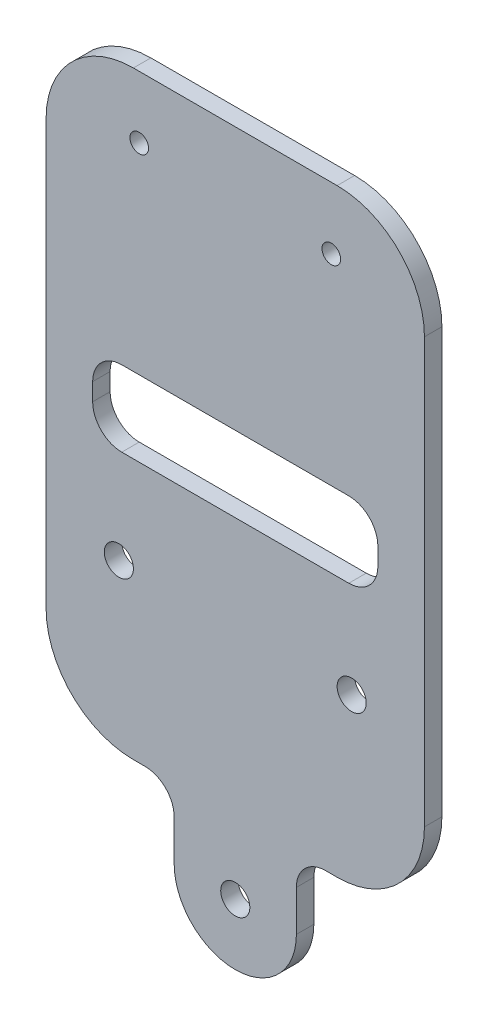
ISO-10303-21;
HEADER;
FILE_DESCRIPTION(('STEP AP214'),'2;1');
FILE_NAME('part.step','',(''),(''),'','','');
FILE_SCHEMA(('AUTOMOTIVE_DESIGN { 1 0 10303 214 1 1 1 1 }'));
ENDSEC;
DATA;
#1=APPLICATION_CONTEXT('core data for automotive mechanical design processes');
#2=APPLICATION_PROTOCOL_DEFINITION('international standard','automotive_design',2000,#1);
#3=PRODUCT_CONTEXT('',#1,'mechanical');
#4=PRODUCT('Part','Part','',(#3));
#5=PRODUCT_RELATED_PRODUCT_CATEGORY('part','',(#4));
#6=PRODUCT_DEFINITION_FORMATION('','',#4);
#7=PRODUCT_DEFINITION_CONTEXT('part definition',#1,'design');
#8=PRODUCT_DEFINITION('design','',#6,#7);
#9=PRODUCT_DEFINITION_SHAPE('','',#8);
#10=(LENGTH_UNIT() NAMED_UNIT(*) SI_UNIT(.MILLI.,.METRE.));
#11=(NAMED_UNIT(*) PLANE_ANGLE_UNIT() SI_UNIT($,.RADIAN.));
#12=(NAMED_UNIT(*) SI_UNIT($,.STERADIAN.) SOLID_ANGLE_UNIT());
#13=UNCERTAINTY_MEASURE_WITH_UNIT(LENGTH_MEASURE(1.E-05),#10,'distance_accuracy_value','');
#14=(GEOMETRIC_REPRESENTATION_CONTEXT(3) GLOBAL_UNCERTAINTY_ASSIGNED_CONTEXT((#13)) GLOBAL_UNIT_ASSIGNED_CONTEXT((#10,
#11,#12)) REPRESENTATION_CONTEXT('',''));
#15=CARTESIAN_POINT('',(0.,0.,0.));
#16=DIRECTION('',(0.,0.,1.));
#17=DIRECTION('',(1.,0.,0.));
#18=AXIS2_PLACEMENT_3D('',#15,#16,#17);
#19=CARTESIAN_POINT('',(0.,0.,3.));
#20=DIRECTION('',(0.,0.,1.));
#21=DIRECTION('',(1.,0.,0.));
#22=AXIS2_PLACEMENT_3D('',#19,#20,#21);
#23=PLANE('',#22);
#24=DIRECTION('',(0.,-1.,0.));
#25=VECTOR('',#24,1.);
#26=CARTESIAN_POINT('',(-12.1,0.,3.));
#27=LINE('',#26,#25);
#28=CARTESIAN_POINT('',(-12.1,36.,3.));
#29=VERTEX_POINT('',#28);
#30=CARTESIAN_POINT('',(-12.1,33.,3.));
#31=VERTEX_POINT('',#30);
#32=EDGE_CURVE('E587',#29,#31,#27,.T.);
#33=ORIENTED_EDGE('',*,*,#32,.F.);
#34=CARTESIAN_POINT('',(-7.10000000000002,36.,3.));
#35=DIRECTION('',(0.,0.,1.));
#36=DIRECTION('',(1.,0.,0.));
#37=AXIS2_PLACEMENT_3D('',#34,#35,#36);
#38=CIRCLE('',#37,5.);
#39=CARTESIAN_POINT('',(-7.10000000000002,41.,3.));
#40=VERTEX_POINT('',#39);
#41=EDGE_CURVE('E396',#29,#40,#38,.F.);
#42=ORIENTED_EDGE('',*,*,#41,.T.);
#43=DIRECTION('',(1.,0.,0.));
#44=VECTOR('',#43,1.);
#45=CARTESIAN_POINT('',(0.,41.,3.));
#46=LINE('',#45,#44);
#47=CARTESIAN_POINT('',(31.9,41.,3.));
#48=VERTEX_POINT('',#47);
#49=EDGE_CURVE('E568',#40,#48,#46,.T.);
#50=ORIENTED_EDGE('',*,*,#49,.T.);
#51=CARTESIAN_POINT('',(31.9,36.,3.));
#52=DIRECTION('',(0.,0.,1.));
#53=DIRECTION('',(1.,0.,0.));
#54=AXIS2_PLACEMENT_3D('',#51,#52,#53);
#55=CIRCLE('',#54,5.);
#56=CARTESIAN_POINT('',(36.9,36.,3.));
#57=VERTEX_POINT('',#56);
#58=EDGE_CURVE('E408',#48,#57,#55,.F.);
#59=ORIENTED_EDGE('',*,*,#58,.T.);
#60=DIRECTION('',(0.,-1.,0.));
#61=VECTOR('',#60,1.);
#62=CARTESIAN_POINT('',(36.9,0.,3.));
#63=LINE('',#62,#61);
#64=CARTESIAN_POINT('',(36.9,33.,3.));
#65=VERTEX_POINT('',#64);
#66=EDGE_CURVE('E562',#57,#65,#63,.T.);
#67=ORIENTED_EDGE('',*,*,#66,.T.);
#68=CARTESIAN_POINT('',(31.9,33.,3.));
#69=DIRECTION('',(0.,0.,1.));
#70=DIRECTION('',(1.,0.,0.));
#71=AXIS2_PLACEMENT_3D('',#68,#69,#70);
#72=CIRCLE('',#71,5.);
#73=CARTESIAN_POINT('',(31.9,28.,3.));
#74=VERTEX_POINT('',#73);
#75=EDGE_CURVE('E414',#65,#74,#72,.F.);
#76=ORIENTED_EDGE('',*,*,#75,.T.);
#77=DIRECTION('',(1.,0.,0.));
#78=VECTOR('',#77,1.);
#79=CARTESIAN_POINT('',(0.,28.,3.));
#80=LINE('',#79,#78);
#81=CARTESIAN_POINT('',(-7.10000000000002,28.,3.));
#82=VERTEX_POINT('',#81);
#83=EDGE_CURVE('E583',#82,#74,#80,.T.);
#84=ORIENTED_EDGE('',*,*,#83,.F.);
#85=CARTESIAN_POINT('',(-7.10000000000002,33.,3.));
#86=DIRECTION('',(0.,0.,1.));
#87=DIRECTION('',(1.,0.,0.));
#88=AXIS2_PLACEMENT_3D('',#85,#86,#87);
#89=CIRCLE('',#88,5.);
#90=EDGE_CURVE('E402',#82,#31,#89,.F.);
#91=ORIENTED_EDGE('',*,*,#90,.T.);
#92=EDGE_LOOP('',(#33,#42,#50,#59,#67,#76,#84,#91));
#93=FACE_BOUND('',#92,.T.);
#94=DIRECTION('',(1.,0.,0.));
#95=VECTOR('',#94,1.);
#96=CARTESIAN_POINT('',(0.,86.1635338636893,3.));
#97=LINE('',#96,#95);
#98=CARTESIAN_POINT('',(-5.10000000000002,86.1635338636893,3.));
#99=VERTEX_POINT('',#98);
#100=CARTESIAN_POINT('',(29.9,86.1635338636893,3.));
#101=VERTEX_POINT('',#100);
#102=EDGE_CURVE('E264',#99,#101,#97,.T.);
#103=ORIENTED_EDGE('',*,*,#102,.F.);
#104=CARTESIAN_POINT('',(-5.10000000000002,71.1635338636893,3.));
#105=DIRECTION('',(0.,0.,1.));
#106=DIRECTION('',(1.,0.,0.));
#107=AXIS2_PLACEMENT_3D('',#104,#105,#106);
#108=CIRCLE('',#107,15.);
#109=CARTESIAN_POINT('',(-20.1,71.1635338636893,3.));
#110=VERTEX_POINT('',#109);
#111=EDGE_CURVE('E320',#99,#110,#108,.T.);
#112=ORIENTED_EDGE('',*,*,#111,.T.);
#113=DIRECTION('',(0.,1.,0.));
#114=VECTOR('',#113,1.);
#115=CARTESIAN_POINT('',(-20.1,0.,3.));
#116=LINE('',#115,#114);
#117=CARTESIAN_POINT('',(-20.1,-1.74999999999998,3.));
#118=VERTEX_POINT('',#117);
#119=EDGE_CURVE('E260',#118,#110,#116,.T.);
#120=ORIENTED_EDGE('',*,*,#119,.F.);
#121=CARTESIAN_POINT('',(-5.10000000000002,-1.74999999999998,3.));
#122=DIRECTION('',(0.,0.,1.));
#123=DIRECTION('',(1.,0.,0.));
#124=AXIS2_PLACEMENT_3D('',#121,#122,#123);
#125=CIRCLE('',#124,15.);
#126=CARTESIAN_POINT('',(-5.10000000000003,-16.75,3.));
#127=VERTEX_POINT('',#126);
#128=EDGE_CURVE('E310',#118,#127,#125,.T.);
#129=ORIENTED_EDGE('',*,*,#128,.T.);
#130=DIRECTION('',(-1.,0.,0.));
#131=VECTOR('',#130,1.);
#132=CARTESIAN_POINT('',(0.,-16.75,3.));
#133=LINE('',#132,#131);
#134=CARTESIAN_POINT('',(-3.10000000000002,-16.75,3.));
#135=VERTEX_POINT('',#134);
#136=EDGE_CURVE('E257',#135,#127,#133,.T.);
#137=ORIENTED_EDGE('',*,*,#136,.F.);
#138=CARTESIAN_POINT('',(-3.10000000000002,-21.75,3.));
#139=DIRECTION('',(0.,0.,1.));
#140=DIRECTION('',(1.,0.,0.));
#141=AXIS2_PLACEMENT_3D('',#138,#139,#140);
#142=CIRCLE('',#141,5.);
#143=CARTESIAN_POINT('',(1.89999999999998,-21.75,3.));
#144=VERTEX_POINT('',#143);
#145=EDGE_CURVE('E420',#135,#144,#142,.F.);
#146=ORIENTED_EDGE('',*,*,#145,.T.);
#147=DIRECTION('',(0.,1.,0.));
#148=VECTOR('',#147,1.);
#149=CARTESIAN_POINT('',(1.89999999999998,0.,3.));
#150=LINE('',#149,#148);
#151=CARTESIAN_POINT('',(1.89999999999998,-28.75,3.));
#152=VERTEX_POINT('',#151);
#153=EDGE_CURVE('E249',#152,#144,#150,.T.);
#154=ORIENTED_EDGE('',*,*,#153,.F.);
#155=CARTESIAN_POINT('',(12.4,-28.75,3.));
#156=DIRECTION('',(0.,0.,1.));
#157=DIRECTION('',(1.,0.,0.));
#158=AXIS2_PLACEMENT_3D('',#155,#156,#157);
#159=CIRCLE('',#158,10.5);
#160=CARTESIAN_POINT('',(22.9,-28.75,3.));
#161=VERTEX_POINT('',#160);
#162=EDGE_CURVE('E234',#152,#161,#159,.T.);
#163=ORIENTED_EDGE('',*,*,#162,.T.);
#164=DIRECTION('',(0.,1.,0.));
#165=VECTOR('',#164,1.);
#166=CARTESIAN_POINT('',(22.9,0.,3.));
#167=LINE('',#166,#165);
#168=CARTESIAN_POINT('',(22.9,-21.75,3.));
#169=VERTEX_POINT('',#168);
#170=EDGE_CURVE('E237',#161,#169,#167,.T.);
#171=ORIENTED_EDGE('',*,*,#170,.T.);
#172=CARTESIAN_POINT('',(27.9,-21.75,3.));
#173=DIRECTION('',(0.,0.,1.));
#174=DIRECTION('',(1.,0.,0.));
#175=AXIS2_PLACEMENT_3D('',#172,#173,#174);
#176=CIRCLE('',#175,5.);
#177=CARTESIAN_POINT('',(27.9,-16.75,3.));
#178=VERTEX_POINT('',#177);
#179=EDGE_CURVE('E74',#169,#178,#176,.F.);
#180=ORIENTED_EDGE('',*,*,#179,.T.);
#181=DIRECTION('',(1.,0.,0.));
#182=VECTOR('',#181,1.);
#183=CARTESIAN_POINT('',(0.,-16.75,3.));
#184=LINE('',#183,#182);
#185=CARTESIAN_POINT('',(29.9,-16.75,3.));
#186=VERTEX_POINT('',#185);
#187=EDGE_CURVE('E272',#178,#186,#184,.T.);
#188=ORIENTED_EDGE('',*,*,#187,.T.);
#189=CARTESIAN_POINT('',(29.9,-1.74999999999997,3.));
#190=DIRECTION('',(0.,0.,1.));
#191=DIRECTION('',(1.,0.,0.));
#192=AXIS2_PLACEMENT_3D('',#189,#190,#191);
#193=CIRCLE('',#192,15.);
#194=CARTESIAN_POINT('',(44.9,-1.74999999999997,3.));
#195=VERTEX_POINT('',#194);
#196=EDGE_CURVE('E314',#186,#195,#193,.T.);
#197=ORIENTED_EDGE('',*,*,#196,.T.);
#198=DIRECTION('',(0.,1.,0.));
#199=VECTOR('',#198,1.);
#200=CARTESIAN_POINT('',(44.9,0.,3.));
#201=LINE('',#200,#199);
#202=CARTESIAN_POINT('',(44.9,71.1635338636892,3.));
#203=VERTEX_POINT('',#202);
#204=EDGE_CURVE('E268',#195,#203,#201,.T.);
#205=ORIENTED_EDGE('',*,*,#204,.T.);
#206=CARTESIAN_POINT('',(29.9,71.1635338636892,3.));
#207=DIRECTION('',(0.,0.,1.));
#208=DIRECTION('',(1.,0.,0.));
#209=AXIS2_PLACEMENT_3D('',#206,#207,#208);
#210=CIRCLE('',#209,15.);
#211=EDGE_CURVE('E317',#203,#101,#210,.T.);
#212=ORIENTED_EDGE('',*,*,#211,.T.);
#213=EDGE_LOOP('',(#103,#112,#120,#129,#137,#146,#154,#163,#171,#180,#188,#197,#205,#212));
#214=FACE_BOUND('',#213,.T.);
#215=CARTESIAN_POINT('',(32.4,11.65,3.));
#216=DIRECTION('',(0.,0.,1.));
#217=DIRECTION('',(1.,0.,0.));
#218=AXIS2_PLACEMENT_3D('',#215,#216,#217);
#219=CIRCLE('',#218,2.5);
#220=CARTESIAN_POINT('',(34.9,11.65,3.));
#221=VERTEX_POINT('',#220);
#222=EDGE_CURVE('E299',#221,#221,#219,.T.);
#223=ORIENTED_EDGE('',*,*,#222,.F.);
#224=EDGE_LOOP('',(#223));
#225=FACE_BOUND('',#224,.T.);
#226=CARTESIAN_POINT('',(-7.60000000000002,11.65,3.));
#227=DIRECTION('',(0.,0.,1.));
#228=DIRECTION('',(1.,0.,0.));
#229=AXIS2_PLACEMENT_3D('',#226,#227,#228);
#230=CIRCLE('',#229,2.5);
#231=CARTESIAN_POINT('',(-5.10000000000002,11.65,3.));
#232=VERTEX_POINT('',#231);
#233=EDGE_CURVE('E295',#232,#232,#230,.T.);
#234=ORIENTED_EDGE('',*,*,#233,.F.);
#235=EDGE_LOOP('',(#234));
#236=FACE_BOUND('',#235,.T.);
#237=CARTESIAN_POINT('',(12.4,-28.75,3.));
#238=DIRECTION('',(0.,0.,1.));
#239=DIRECTION('',(1.,0.,0.));
#240=AXIS2_PLACEMENT_3D('',#237,#238,#239);
#241=CIRCLE('',#240,2.5);
#242=CARTESIAN_POINT('',(14.9,-28.75,3.));
#243=VERTEX_POINT('',#242);
#244=EDGE_CURVE('E284',#243,#243,#241,.T.);
#245=ORIENTED_EDGE('',*,*,#244,.F.);
#246=EDGE_LOOP('',(#245));
#247=FACE_BOUND('',#246,.T.);
#248=CARTESIAN_POINT('',(-4.10000000000002,75.5,3.));
#249=DIRECTION('',(0.,0.,1.));
#250=DIRECTION('',(1.,0.,0.));
#251=AXIS2_PLACEMENT_3D('',#248,#249,#250);
#252=CIRCLE('',#251,1.60000000000001);
#253=CARTESIAN_POINT('',(-2.50000000000001,75.5,3.));
#254=VERTEX_POINT('',#253);
#255=EDGE_CURVE('E611',#254,#254,#252,.T.);
#256=ORIENTED_EDGE('',*,*,#255,.F.);
#257=EDGE_LOOP('',(#256));
#258=FACE_BOUND('',#257,.T.);
#259=CARTESIAN_POINT('',(28.9,75.5,3.));
#260=DIRECTION('',(0.,0.,1.));
#261=DIRECTION('',(1.,0.,0.));
#262=AXIS2_PLACEMENT_3D('',#259,#260,#261);
#263=CIRCLE('',#262,1.60000000000001);
#264=CARTESIAN_POINT('',(30.5,75.5,3.));
#265=VERTEX_POINT('',#264);
#266=EDGE_CURVE('E605',#265,#265,#263,.F.);
#267=ORIENTED_EDGE('',*,*,#266,.T.);
#268=EDGE_LOOP('',(#267));
#269=FACE_BOUND('',#268,.T.);
#270=ADVANCED_FACE('F65',(#93,#214,#225,#236,#247,#258,#269),#23,.T.);
#271=CARTESIAN_POINT('',(0.,0.,0.));
#272=DIRECTION('',(0.,0.,1.));
#273=DIRECTION('',(1.,0.,0.));
#274=AXIS2_PLACEMENT_3D('',#271,#272,#273);
#275=PLANE('',#274);
#276=CARTESIAN_POINT('',(-4.10000000000002,75.5,0.));
#277=DIRECTION('',(0.,0.,1.));
#278=DIRECTION('',(1.,0.,0.));
#279=AXIS2_PLACEMENT_3D('',#276,#277,#278);
#280=CIRCLE('',#279,1.60000000000001);
#281=CARTESIAN_POINT('',(-2.50000000000001,75.5,0.));
#282=VERTEX_POINT('',#281);
#283=EDGE_CURVE('E606',#282,#282,#280,.F.);
#284=ORIENTED_EDGE('',*,*,#283,.F.);
#285=EDGE_LOOP('',(#284));
#286=FACE_BOUND('',#285,.T.);
#287=DIRECTION('',(0.,-1.,0.));
#288=VECTOR('',#287,1.);
#289=CARTESIAN_POINT('',(-20.1,0.,0.));
#290=LINE('',#289,#288);
#291=CARTESIAN_POINT('',(-20.1,71.1635338636893,0.));
#292=VERTEX_POINT('',#291);
#293=CARTESIAN_POINT('',(-20.1,-1.74999999999998,0.));
#294=VERTEX_POINT('',#293);
#295=EDGE_CURVE('E436',#292,#294,#290,.T.);
#296=ORIENTED_EDGE('',*,*,#295,.F.);
#297=CARTESIAN_POINT('',(-5.10000000000002,71.1635338636893,0.));
#298=DIRECTION('',(0.,0.,1.));
#299=DIRECTION('',(1.,0.,0.));
#300=AXIS2_PLACEMENT_3D('',#297,#298,#299);
#301=CIRCLE('',#300,15.);
#302=CARTESIAN_POINT('',(-5.10000000000002,86.1635338636893,0.));
#303=VERTEX_POINT('',#302);
#304=EDGE_CURVE('E339',#292,#303,#301,.F.);
#305=ORIENTED_EDGE('',*,*,#304,.T.);
#306=DIRECTION('',(-1.,0.,0.));
#307=VECTOR('',#306,1.);
#308=CARTESIAN_POINT('',(0.,86.1635338636893,0.));
#309=LINE('',#308,#307);
#310=CARTESIAN_POINT('',(29.9,86.1635338636893,0.));
#311=VERTEX_POINT('',#310);
#312=EDGE_CURVE('E451',#311,#303,#309,.T.);
#313=ORIENTED_EDGE('',*,*,#312,.F.);
#314=CARTESIAN_POINT('',(29.9,71.1635338636892,0.));
#315=DIRECTION('',(0.,0.,1.));
#316=DIRECTION('',(1.,0.,0.));
#317=AXIS2_PLACEMENT_3D('',#314,#315,#316);
#318=CIRCLE('',#317,15.);
#319=CARTESIAN_POINT('',(44.9,71.1635338636892,0.));
#320=VERTEX_POINT('',#319);
#321=EDGE_CURVE('E336',#311,#320,#318,.F.);
#322=ORIENTED_EDGE('',*,*,#321,.T.);
#323=DIRECTION('',(0.,-1.,0.));
#324=VECTOR('',#323,1.);
#325=CARTESIAN_POINT('',(44.9,0.,0.));
#326=LINE('',#325,#324);
#327=CARTESIAN_POINT('',(44.9,-1.74999999999997,0.));
#328=VERTEX_POINT('',#327);
#329=EDGE_CURVE('E455',#320,#328,#326,.T.);
#330=ORIENTED_EDGE('',*,*,#329,.T.);
#331=CARTESIAN_POINT('',(29.9,-1.74999999999997,0.));
#332=DIRECTION('',(0.,0.,1.));
#333=DIRECTION('',(1.,0.,0.));
#334=AXIS2_PLACEMENT_3D('',#331,#332,#333);
#335=CIRCLE('',#334,15.);
#336=CARTESIAN_POINT('',(29.9,-16.75,0.));
#337=VERTEX_POINT('',#336);
#338=EDGE_CURVE('E333',#328,#337,#335,.F.);
#339=ORIENTED_EDGE('',*,*,#338,.T.);
#340=DIRECTION('',(-1.,0.,0.));
#341=VECTOR('',#340,1.);
#342=CARTESIAN_POINT('',(0.,-16.75,0.));
#343=LINE('',#342,#341);
#344=CARTESIAN_POINT('',(27.9,-16.75,0.));
#345=VERTEX_POINT('',#344);
#346=EDGE_CURVE('E251',#337,#345,#343,.T.);
#347=ORIENTED_EDGE('',*,*,#346,.T.);
#348=CARTESIAN_POINT('',(27.9,-21.75,0.));
#349=DIRECTION('',(0.,0.,1.));
#350=DIRECTION('',(1.,0.,0.));
#351=AXIS2_PLACEMENT_3D('',#348,#349,#350);
#352=CIRCLE('',#351,5.);
#353=CARTESIAN_POINT('',(22.9,-21.75,0.));
#354=VERTEX_POINT('',#353);
#355=EDGE_CURVE('E12',#345,#354,#352,.T.);
#356=ORIENTED_EDGE('',*,*,#355,.T.);
#357=DIRECTION('',(0.,-1.,0.));
#358=VECTOR('',#357,1.);
#359=CARTESIAN_POINT('',(22.9,0.,0.));
#360=LINE('',#359,#358);
#361=CARTESIAN_POINT('',(22.9,-28.75,0.));
#362=VERTEX_POINT('',#361);
#363=EDGE_CURVE('E243',#354,#362,#360,.T.);
#364=ORIENTED_EDGE('',*,*,#363,.T.);
#365=CARTESIAN_POINT('',(12.4,-28.75,0.));
#366=DIRECTION('',(0.,0.,1.));
#367=DIRECTION('',(1.,0.,0.));
#368=AXIS2_PLACEMENT_3D('',#365,#366,#367);
#369=CIRCLE('',#368,10.5);
#370=CARTESIAN_POINT('',(1.89999999999998,-28.75,0.));
#371=VERTEX_POINT('',#370);
#372=EDGE_CURVE('E232',#362,#371,#369,.F.);
#373=ORIENTED_EDGE('',*,*,#372,.T.);
#374=DIRECTION('',(0.,-1.,0.));
#375=VECTOR('',#374,1.);
#376=CARTESIAN_POINT('',(1.89999999999998,0.,0.));
#377=LINE('',#376,#375);
#378=CARTESIAN_POINT('',(1.89999999999998,-21.75,0.));
#379=VERTEX_POINT('',#378);
#380=EDGE_CURVE('E214',#379,#371,#377,.T.);
#381=ORIENTED_EDGE('',*,*,#380,.F.);
#382=CARTESIAN_POINT('',(-3.10000000000002,-21.75,0.));
#383=DIRECTION('',(0.,0.,1.));
#384=DIRECTION('',(1.,0.,0.));
#385=AXIS2_PLACEMENT_3D('',#382,#383,#384);
#386=CIRCLE('',#385,5.);
#387=CARTESIAN_POINT('',(-3.10000000000002,-16.75,0.));
#388=VERTEX_POINT('',#387);
#389=EDGE_CURVE('E423',#379,#388,#386,.T.);
#390=ORIENTED_EDGE('',*,*,#389,.T.);
#391=DIRECTION('',(1.,0.,0.));
#392=VECTOR('',#391,1.);
#393=CARTESIAN_POINT('',(0.,-16.75,0.));
#394=LINE('',#393,#392);
#395=CARTESIAN_POINT('',(-5.10000000000003,-16.75,0.));
#396=VERTEX_POINT('',#395);
#397=EDGE_CURVE('E226',#396,#388,#394,.T.);
#398=ORIENTED_EDGE('',*,*,#397,.F.);
#399=CARTESIAN_POINT('',(-5.10000000000002,-1.74999999999998,0.));
#400=DIRECTION('',(0.,0.,1.));
#401=DIRECTION('',(1.,0.,0.));
#402=AXIS2_PLACEMENT_3D('',#399,#400,#401);
#403=CIRCLE('',#402,15.);
#404=EDGE_CURVE('E330',#396,#294,#403,.F.);
#405=ORIENTED_EDGE('',*,*,#404,.T.);
#406=EDGE_LOOP('',(#296,#305,#313,#322,#330,#339,#347,#356,#364,#373,#381,#390,#398,#405));
#407=FACE_BOUND('',#406,.T.);
#408=CARTESIAN_POINT('',(32.4,11.65,0.));
#409=DIRECTION('',(0.,0.,-1.));
#410=DIRECTION('',(-1.,0.,0.));
#411=AXIS2_PLACEMENT_3D('',#408,#409,#410);
#412=CIRCLE('',#411,2.5);
#413=CARTESIAN_POINT('',(29.9,11.65,0.));
#414=VERTEX_POINT('',#413);
#415=EDGE_CURVE('E280',#414,#414,#412,.T.);
#416=ORIENTED_EDGE('',*,*,#415,.F.);
#417=EDGE_LOOP('',(#416));
#418=FACE_BOUND('',#417,.T.);
#419=CARTESIAN_POINT('',(-7.60000000000002,11.65,0.));
#420=DIRECTION('',(0.,0.,-1.));
#421=DIRECTION('',(-1.,0.,0.));
#422=AXIS2_PLACEMENT_3D('',#419,#420,#421);
#423=CIRCLE('',#422,2.5);
#424=CARTESIAN_POINT('',(-10.1,11.65,0.));
#425=VERTEX_POINT('',#424);
#426=EDGE_CURVE('E285',#425,#425,#423,.T.);
#427=ORIENTED_EDGE('',*,*,#426,.F.);
#428=EDGE_LOOP('',(#427));
#429=FACE_BOUND('',#428,.T.);
#430=CARTESIAN_POINT('',(12.4,-28.75,0.));
#431=DIRECTION('',(0.,0.,-1.));
#432=DIRECTION('',(-1.,0.,0.));
#433=AXIS2_PLACEMENT_3D('',#430,#431,#432);
#434=CIRCLE('',#433,2.5);
#435=CARTESIAN_POINT('',(9.89999999999998,-28.75,0.));
#436=VERTEX_POINT('',#435);
#437=EDGE_CURVE('E278',#436,#436,#434,.T.);
#438=ORIENTED_EDGE('',*,*,#437,.F.);
#439=EDGE_LOOP('',(#438));
#440=FACE_BOUND('',#439,.T.);
#441=DIRECTION('',(-1.,0.,0.));
#442=VECTOR('',#441,1.);
#443=CARTESIAN_POINT('',(0.,28.,0.));
#444=LINE('',#443,#442);
#445=CARTESIAN_POINT('',(31.9,28.,0.));
#446=VERTEX_POINT('',#445);
#447=CARTESIAN_POINT('',(-7.10000000000002,28.,0.));
#448=VERTEX_POINT('',#447);
#449=EDGE_CURVE('E597',#446,#448,#444,.T.);
#450=ORIENTED_EDGE('',*,*,#449,.F.);
#451=CARTESIAN_POINT('',(31.9,33.,0.));
#452=DIRECTION('',(0.,0.,1.));
#453=DIRECTION('',(1.,0.,0.));
#454=AXIS2_PLACEMENT_3D('',#451,#452,#453);
#455=CIRCLE('',#454,5.);
#456=CARTESIAN_POINT('',(36.9,33.,0.));
#457=VERTEX_POINT('',#456);
#458=EDGE_CURVE('E417',#446,#457,#455,.T.);
#459=ORIENTED_EDGE('',*,*,#458,.T.);
#460=DIRECTION('',(0.,1.,0.));
#461=VECTOR('',#460,1.);
#462=CARTESIAN_POINT('',(36.9,0.,0.));
#463=LINE('',#462,#461);
#464=CARTESIAN_POINT('',(36.9,36.,0.));
#465=VERTEX_POINT('',#464);
#466=EDGE_CURVE('E569',#457,#465,#463,.T.);
#467=ORIENTED_EDGE('',*,*,#466,.T.);
#468=CARTESIAN_POINT('',(31.9,36.,0.));
#469=DIRECTION('',(0.,0.,1.));
#470=DIRECTION('',(1.,0.,0.));
#471=AXIS2_PLACEMENT_3D('',#468,#469,#470);
#472=CIRCLE('',#471,5.);
#473=CARTESIAN_POINT('',(31.9,41.,0.));
#474=VERTEX_POINT('',#473);
#475=EDGE_CURVE('E411',#465,#474,#472,.T.);
#476=ORIENTED_EDGE('',*,*,#475,.T.);
#477=DIRECTION('',(-1.,0.,0.));
#478=VECTOR('',#477,1.);
#479=CARTESIAN_POINT('',(0.,41.,0.));
#480=LINE('',#479,#478);
#481=CARTESIAN_POINT('',(-7.10000000000002,41.,0.));
#482=VERTEX_POINT('',#481);
#483=EDGE_CURVE('E227',#474,#482,#480,.T.);
#484=ORIENTED_EDGE('',*,*,#483,.T.);
#485=CARTESIAN_POINT('',(-7.10000000000002,36.,0.));
#486=DIRECTION('',(0.,0.,1.));
#487=DIRECTION('',(1.,0.,0.));
#488=AXIS2_PLACEMENT_3D('',#485,#486,#487);
#489=CIRCLE('',#488,5.);
#490=CARTESIAN_POINT('',(-12.1,36.,0.));
#491=VERTEX_POINT('',#490);
#492=EDGE_CURVE('E399',#482,#491,#489,.T.);
#493=ORIENTED_EDGE('',*,*,#492,.T.);
#494=DIRECTION('',(0.,1.,0.));
#495=VECTOR('',#494,1.);
#496=CARTESIAN_POINT('',(-12.1,0.,0.));
#497=LINE('',#496,#495);
#498=CARTESIAN_POINT('',(-12.1,33.,0.));
#499=VERTEX_POINT('',#498);
#500=EDGE_CURVE('E601',#499,#491,#497,.T.);
#501=ORIENTED_EDGE('',*,*,#500,.F.);
#502=CARTESIAN_POINT('',(-7.10000000000002,33.,0.));
#503=DIRECTION('',(0.,0.,1.));
#504=DIRECTION('',(1.,0.,0.));
#505=AXIS2_PLACEMENT_3D('',#502,#503,#504);
#506=CIRCLE('',#505,5.);
#507=EDGE_CURVE('E405',#499,#448,#506,.T.);
#508=ORIENTED_EDGE('',*,*,#507,.T.);
#509=EDGE_LOOP('',(#450,#459,#467,#476,#484,#493,#501,#508));
#510=FACE_BOUND('',#509,.T.);
#511=CARTESIAN_POINT('',(28.9,75.5,0.));
#512=DIRECTION('',(0.,0.,1.));
#513=DIRECTION('',(1.,0.,0.));
#514=AXIS2_PLACEMENT_3D('',#511,#512,#513);
#515=CIRCLE('',#514,1.60000000000001);
#516=CARTESIAN_POINT('',(30.5,75.5,0.));
#517=VERTEX_POINT('',#516);
#518=EDGE_CURVE('E610',#517,#517,#515,.T.);
#519=ORIENTED_EDGE('',*,*,#518,.T.);
#520=EDGE_LOOP('',(#519));
#521=FACE_BOUND('',#520,.T.);
#522=ADVANCED_FACE('F240',(#286,#407,#418,#429,#440,#510,#521),#275,.F.);
#523=CARTESIAN_POINT('',(12.4,-28.75,10.));
#524=DIRECTION('',(0.,0.,-1.));
#525=DIRECTION('',(-1.,0.,0.));
#526=AXIS2_PLACEMENT_3D('',#523,#524,#525);
#527=CYLINDRICAL_SURFACE('',#526,2.5);
#528=ORIENTED_EDGE('',*,*,#244,.T.);
#529=EDGE_LOOP('',(#528));
#530=FACE_BOUND('',#529,.T.);
#531=ORIENTED_EDGE('',*,*,#437,.T.);
#532=EDGE_LOOP('',(#531));
#533=FACE_BOUND('',#532,.T.);
#534=ADVANCED_FACE('F487',(#530,#533),#527,.F.);
#535=CARTESIAN_POINT('',(-7.60000000000002,11.65,10.));
#536=DIRECTION('',(0.,0.,-1.));
#537=DIRECTION('',(-1.,0.,0.));
#538=AXIS2_PLACEMENT_3D('',#535,#536,#537);
#539=CYLINDRICAL_SURFACE('',#538,2.5);
#540=ORIENTED_EDGE('',*,*,#233,.T.);
#541=EDGE_LOOP('',(#540));
#542=FACE_BOUND('',#541,.T.);
#543=ORIENTED_EDGE('',*,*,#426,.T.);
#544=EDGE_LOOP('',(#543));
#545=FACE_BOUND('',#544,.T.);
#546=ADVANCED_FACE('F641',(#542,#545),#539,.F.);
#547=CARTESIAN_POINT('',(32.4,11.65,10.));
#548=DIRECTION('',(0.,0.,-1.));
#549=DIRECTION('',(-1.,0.,0.));
#550=AXIS2_PLACEMENT_3D('',#547,#548,#549);
#551=CYLINDRICAL_SURFACE('',#550,2.5);
#552=ORIENTED_EDGE('',*,*,#222,.T.);
#553=EDGE_LOOP('',(#552));
#554=FACE_BOUND('',#553,.T.);
#555=ORIENTED_EDGE('',*,*,#415,.T.);
#556=EDGE_LOOP('',(#555));
#557=FACE_BOUND('',#556,.T.);
#558=ADVANCED_FACE('F478',(#554,#557),#551,.F.);
#559=CARTESIAN_POINT('',(12.4,-28.75,-0.00100000000000013));
#560=DIRECTION('',(0.,0.,1.));
#561=DIRECTION('',(1.,0.,0.));
#562=AXIS2_PLACEMENT_3D('',#559,#560,#561);
#563=CYLINDRICAL_SURFACE('',#562,10.5);
#564=DIRECTION('',(0.,0.,1.));
#565=VECTOR('',#564,1.);
#566=CARTESIAN_POINT('',(22.9,-28.75,-0.00100000000000013));
#567=LINE('',#566,#565);
#568=EDGE_CURVE('E236',#362,#161,#567,.T.);
#569=ORIENTED_EDGE('',*,*,#568,.T.);
#570=ORIENTED_EDGE('',*,*,#162,.F.);
#571=DIRECTION('',(0.,0.,1.));
#572=VECTOR('',#571,1.);
#573=CARTESIAN_POINT('',(1.89999999999998,-28.75,-0.00100000000000013));
#574=LINE('',#573,#572);
#575=EDGE_CURVE('E218',#371,#152,#574,.T.);
#576=ORIENTED_EDGE('',*,*,#575,.F.);
#577=ORIENTED_EDGE('',*,*,#372,.F.);
#578=EDGE_LOOP('',(#569,#570,#576,#577));
#579=FACE_BOUND('',#578,.T.);
#580=ADVANCED_FACE('F231',(#579),#563,.T.);
#581=CARTESIAN_POINT('',(22.9,0.,-0.00100000000000013));
#582=DIRECTION('',(1.,0.,0.));
#583=DIRECTION('',(0.,0.,-1.));
#584=AXIS2_PLACEMENT_3D('',#581,#582,#583);
#585=PLANE('',#584);
#586=ORIENTED_EDGE('',*,*,#363,.F.);
#587=DIRECTION('',(0.,0.,1.));
#588=VECTOR('',#587,1.);
#589=CARTESIAN_POINT('',(22.9,-21.75,3.));
#590=LINE('',#589,#588);
#591=EDGE_CURVE('E390',#354,#169,#590,.T.);
#592=ORIENTED_EDGE('',*,*,#591,.T.);
#593=ORIENTED_EDGE('',*,*,#170,.F.);
#594=ORIENTED_EDGE('',*,*,#568,.F.);
#595=EDGE_LOOP('',(#586,#592,#593,#594));
#596=FACE_BOUND('',#595,.T.);
#597=ADVANCED_FACE('F468',(#596),#585,.T.);
#598=CARTESIAN_POINT('',(0.,-16.75,-0.00100000000000013));
#599=DIRECTION('',(0.,-1.,0.));
#600=DIRECTION('',(1.,0.,0.));
#601=AXIS2_PLACEMENT_3D('',#598,#599,#600);
#602=PLANE('',#601);
#603=ORIENTED_EDGE('',*,*,#187,.F.);
#604=DIRECTION('',(0.,0.,1.));
#605=VECTOR('',#604,1.);
#606=CARTESIAN_POINT('',(27.9,-16.75,0.));
#607=LINE('',#606,#605);
#608=EDGE_CURVE('E87',#178,#345,#607,.F.);
#609=ORIENTED_EDGE('',*,*,#608,.T.);
#610=ORIENTED_EDGE('',*,*,#346,.F.);
#611=DIRECTION('',(0.,0.,1.));
#612=VECTOR('',#611,1.);
#613=CARTESIAN_POINT('',(29.9,-16.75,-0.00100000000000013));
#614=LINE('',#613,#612);
#615=EDGE_CURVE('E349',#337,#186,#614,.T.);
#616=ORIENTED_EDGE('',*,*,#615,.T.);
#617=EDGE_LOOP('',(#603,#609,#610,#616));
#618=FACE_BOUND('',#617,.T.);
#619=ADVANCED_FACE('F470',(#618),#602,.T.);
#620=CARTESIAN_POINT('',(44.9,0.,-0.00100000000000013));
#621=DIRECTION('',(1.,0.,0.));
#622=DIRECTION('',(0.,0.,-1.));
#623=AXIS2_PLACEMENT_3D('',#620,#621,#622);
#624=PLANE('',#623);
#625=ORIENTED_EDGE('',*,*,#329,.F.);
#626=DIRECTION('',(0.,0.,1.));
#627=VECTOR('',#626,1.);
#628=CARTESIAN_POINT('',(44.9,71.1635338636892,3.));
#629=LINE('',#628,#627);
#630=EDGE_CURVE('E345',#320,#203,#629,.T.);
#631=ORIENTED_EDGE('',*,*,#630,.T.);
#632=ORIENTED_EDGE('',*,*,#204,.F.);
#633=DIRECTION('',(0.,0.,1.));
#634=VECTOR('',#633,1.);
#635=CARTESIAN_POINT('',(44.9,-1.74999999999997,-0.00100000000000013));
#636=LINE('',#635,#634);
#637=EDGE_CURVE('E342',#195,#328,#636,.F.);
#638=ORIENTED_EDGE('',*,*,#637,.T.);
#639=EDGE_LOOP('',(#625,#631,#632,#638));
#640=FACE_BOUND('',#639,.T.);
#641=ADVANCED_FACE('F476',(#640),#624,.T.);
#642=CARTESIAN_POINT('',(0.,86.1635338636893,-0.00100000000000013));
#643=DIRECTION('',(0.,-1.,0.));
#644=DIRECTION('',(0.,0.,-1.));
#645=AXIS2_PLACEMENT_3D('',#642,#643,#644);
#646=PLANE('',#645);
#647=ORIENTED_EDGE('',*,*,#312,.T.);
#648=DIRECTION('',(0.,0.,1.));
#649=VECTOR('',#648,1.);
#650=CARTESIAN_POINT('',(-5.10000000000002,86.1635338636893,-0.00100000000000013));
#651=LINE('',#650,#649);
#652=EDGE_CURVE('E306',#303,#99,#651,.T.);
#653=ORIENTED_EDGE('',*,*,#652,.T.);
#654=ORIENTED_EDGE('',*,*,#102,.T.);
#655=DIRECTION('',(0.,0.,1.));
#656=VECTOR('',#655,1.);
#657=CARTESIAN_POINT('',(29.9,86.1635338636893,0.));
#658=LINE('',#657,#656);
#659=EDGE_CURVE('E303',#101,#311,#658,.F.);
#660=ORIENTED_EDGE('',*,*,#659,.T.);
#661=EDGE_LOOP('',(#647,#653,#654,#660));
#662=FACE_BOUND('',#661,.T.);
#663=ADVANCED_FACE('F789',(#662),#646,.F.);
#664=CARTESIAN_POINT('',(-20.1,0.,-0.00100000000000013));
#665=DIRECTION('',(1.,0.,0.));
#666=DIRECTION('',(0.,0.,-1.));
#667=AXIS2_PLACEMENT_3D('',#664,#665,#666);
#668=PLANE('',#667);
#669=ORIENTED_EDGE('',*,*,#119,.T.);
#670=DIRECTION('',(0.,0.,1.));
#671=VECTOR('',#670,1.);
#672=CARTESIAN_POINT('',(-20.1,71.1635338636893,-0.00100000000000013));
#673=LINE('',#672,#671);
#674=EDGE_CURVE('E327',#110,#292,#673,.F.);
#675=ORIENTED_EDGE('',*,*,#674,.T.);
#676=ORIENTED_EDGE('',*,*,#295,.T.);
#677=DIRECTION('',(0.,0.,1.));
#678=VECTOR('',#677,1.);
#679=CARTESIAN_POINT('',(-20.1,-1.74999999999998,-0.00100000000000013));
#680=LINE('',#679,#678);
#681=EDGE_CURVE('E323',#294,#118,#680,.T.);
#682=ORIENTED_EDGE('',*,*,#681,.T.);
#683=EDGE_LOOP('',(#669,#675,#676,#682));
#684=FACE_BOUND('',#683,.T.);
#685=ADVANCED_FACE('F448',(#684),#668,.F.);
#686=CARTESIAN_POINT('',(0.,-16.75,-0.00100000000000013));
#687=DIRECTION('',(0.,1.,0.));
#688=DIRECTION('',(-1.,0.,0.));
#689=AXIS2_PLACEMENT_3D('',#686,#687,#688);
#690=PLANE('',#689);
#691=ORIENTED_EDGE('',*,*,#397,.T.);
#692=DIRECTION('',(0.,0.,1.));
#693=VECTOR('',#692,1.);
#694=CARTESIAN_POINT('',(-3.10000000000002,-16.75,3.));
#695=LINE('',#694,#693);
#696=EDGE_CURVE('E384',#388,#135,#695,.T.);
#697=ORIENTED_EDGE('',*,*,#696,.T.);
#698=ORIENTED_EDGE('',*,*,#136,.T.);
#699=DIRECTION('',(0.,0.,1.));
#700=VECTOR('',#699,1.);
#701=CARTESIAN_POINT('',(-5.10000000000003,-16.75,-0.00100000000000013));
#702=LINE('',#701,#700);
#703=EDGE_CURVE('E353',#127,#396,#702,.F.);
#704=ORIENTED_EDGE('',*,*,#703,.T.);
#705=EDGE_LOOP('',(#691,#697,#698,#704));
#706=FACE_BOUND('',#705,.T.);
#707=ADVANCED_FACE('F432',(#706),#690,.F.);
#708=CARTESIAN_POINT('',(1.89999999999998,0.,-0.00100000000000013));
#709=DIRECTION('',(1.,0.,0.));
#710=DIRECTION('',(0.,0.,-1.));
#711=AXIS2_PLACEMENT_3D('',#708,#709,#710);
#712=PLANE('',#711);
#713=ORIENTED_EDGE('',*,*,#153,.T.);
#714=DIRECTION('',(0.,0.,1.));
#715=VECTOR('',#714,1.);
#716=CARTESIAN_POINT('',(1.89999999999998,-21.75,0.));
#717=LINE('',#716,#715);
#718=EDGE_CURVE('E221',#144,#379,#717,.F.);
#719=ORIENTED_EDGE('',*,*,#718,.T.);
#720=ORIENTED_EDGE('',*,*,#380,.T.);
#721=ORIENTED_EDGE('',*,*,#575,.T.);
#722=EDGE_LOOP('',(#713,#719,#720,#721));
#723=FACE_BOUND('',#722,.T.);
#724=ADVANCED_FACE('F217',(#723),#712,.F.);
#725=CARTESIAN_POINT('',(36.9,0.,-0.00100000000000013));
#726=DIRECTION('',(-1.,0.,0.));
#727=DIRECTION('',(0.,0.,1.));
#728=AXIS2_PLACEMENT_3D('',#725,#726,#727);
#729=PLANE('',#728);
#730=ORIENTED_EDGE('',*,*,#66,.F.);
#731=DIRECTION('',(0.,0.,1.));
#732=VECTOR('',#731,1.);
#733=CARTESIAN_POINT('',(36.9,36.,0.));
#734=LINE('',#733,#732);
#735=EDGE_CURVE('E381',#57,#465,#734,.F.);
#736=ORIENTED_EDGE('',*,*,#735,.T.);
#737=ORIENTED_EDGE('',*,*,#466,.F.);
#738=DIRECTION('',(0.,0.,1.));
#739=VECTOR('',#738,1.);
#740=CARTESIAN_POINT('',(36.9,33.,-0.00100000000000013));
#741=LINE('',#740,#739);
#742=EDGE_CURVE('E377',#457,#65,#741,.T.);
#743=ORIENTED_EDGE('',*,*,#742,.T.);
#744=EDGE_LOOP('',(#730,#736,#737,#743));
#745=FACE_BOUND('',#744,.T.);
#746=ADVANCED_FACE('F547',(#745),#729,.T.);
#747=CARTESIAN_POINT('',(0.,28.,-0.00100000000000013));
#748=DIRECTION('',(0.,-1.,0.));
#749=DIRECTION('',(0.,0.,-1.));
#750=AXIS2_PLACEMENT_3D('',#747,#748,#749);
#751=PLANE('',#750);
#752=ORIENTED_EDGE('',*,*,#449,.T.);
#753=DIRECTION('',(0.,0.,1.));
#754=VECTOR('',#753,1.);
#755=CARTESIAN_POINT('',(-7.10000000000002,28.,3.));
#756=LINE('',#755,#754);
#757=EDGE_CURVE('E373',#448,#82,#756,.T.);
#758=ORIENTED_EDGE('',*,*,#757,.T.);
#759=ORIENTED_EDGE('',*,*,#83,.T.);
#760=DIRECTION('',(0.,0.,1.));
#761=VECTOR('',#760,1.);
#762=CARTESIAN_POINT('',(31.9,28.,-0.00100000000000013));
#763=LINE('',#762,#761);
#764=EDGE_CURVE('E370',#74,#446,#763,.F.);
#765=ORIENTED_EDGE('',*,*,#764,.T.);
#766=EDGE_LOOP('',(#752,#758,#759,#765));
#767=FACE_BOUND('',#766,.T.);
#768=ADVANCED_FACE('F543',(#767),#751,.F.);
#769=CARTESIAN_POINT('',(-12.1,0.,-0.00100000000000013));
#770=DIRECTION('',(-1.,0.,0.));
#771=DIRECTION('',(0.,-1.,0.));
#772=AXIS2_PLACEMENT_3D('',#769,#770,#771);
#773=PLANE('',#772);
#774=ORIENTED_EDGE('',*,*,#500,.T.);
#775=DIRECTION('',(0.,0.,1.));
#776=VECTOR('',#775,1.);
#777=CARTESIAN_POINT('',(-12.1,36.,-0.00100000000000013));
#778=LINE('',#777,#776);
#779=EDGE_CURVE('E359',#491,#29,#778,.T.);
#780=ORIENTED_EDGE('',*,*,#779,.T.);
#781=ORIENTED_EDGE('',*,*,#32,.T.);
#782=DIRECTION('',(0.,0.,1.));
#783=VECTOR('',#782,1.);
#784=CARTESIAN_POINT('',(-12.1,33.,0.));
#785=LINE('',#784,#783);
#786=EDGE_CURVE('E356',#31,#499,#785,.F.);
#787=ORIENTED_EDGE('',*,*,#786,.T.);
#788=EDGE_LOOP('',(#774,#780,#781,#787));
#789=FACE_BOUND('',#788,.T.);
#790=ADVANCED_FACE('F546',(#789),#773,.F.);
#791=CARTESIAN_POINT('',(0.,41.,-0.00100000000000013));
#792=DIRECTION('',(0.,-1.,0.));
#793=DIRECTION('',(0.,0.,-1.));
#794=AXIS2_PLACEMENT_3D('',#791,#792,#793);
#795=PLANE('',#794);
#796=ORIENTED_EDGE('',*,*,#49,.F.);
#797=DIRECTION('',(0.,0.,1.));
#798=VECTOR('',#797,1.);
#799=CARTESIAN_POINT('',(-7.10000000000002,41.,-0.00100000000000013));
#800=LINE('',#799,#798);
#801=EDGE_CURVE('E367',#40,#482,#800,.F.);
#802=ORIENTED_EDGE('',*,*,#801,.T.);
#803=ORIENTED_EDGE('',*,*,#483,.F.);
#804=DIRECTION('',(0.,0.,1.));
#805=VECTOR('',#804,1.);
#806=CARTESIAN_POINT('',(31.9,41.,3.));
#807=LINE('',#806,#805);
#808=EDGE_CURVE('E363',#474,#48,#807,.T.);
#809=ORIENTED_EDGE('',*,*,#808,.T.);
#810=EDGE_LOOP('',(#796,#802,#803,#809));
#811=FACE_BOUND('',#810,.T.);
#812=ADVANCED_FACE('F498',(#811),#795,.T.);
#813=CARTESIAN_POINT('',(-5.10000000000002,71.1635338636893,-0.00100000000000013));
#814=DIRECTION('',(0.,0.,1.));
#815=DIRECTION('',(1.,0.,0.));
#816=AXIS2_PLACEMENT_3D('',#813,#814,#815);
#817=CYLINDRICAL_SURFACE('',#816,15.);
#818=ORIENTED_EDGE('',*,*,#304,.F.);
#819=ORIENTED_EDGE('',*,*,#674,.F.);
#820=ORIENTED_EDGE('',*,*,#111,.F.);
#821=ORIENTED_EDGE('',*,*,#652,.F.);
#822=EDGE_LOOP('',(#818,#819,#820,#821));
#823=FACE_BOUND('',#822,.T.);
#824=ADVANCED_FACE('F494',(#823),#817,.T.);
#825=CARTESIAN_POINT('',(29.9,71.1635338636892,-0.00100000000000013));
#826=DIRECTION('',(0.,0.,-1.));
#827=DIRECTION('',(-1.,0.,0.));
#828=AXIS2_PLACEMENT_3D('',#825,#826,#827);
#829=CYLINDRICAL_SURFACE('',#828,15.);
#830=ORIENTED_EDGE('',*,*,#321,.F.);
#831=ORIENTED_EDGE('',*,*,#659,.F.);
#832=ORIENTED_EDGE('',*,*,#211,.F.);
#833=ORIENTED_EDGE('',*,*,#630,.F.);
#834=EDGE_LOOP('',(#830,#831,#832,#833));
#835=FACE_BOUND('',#834,.T.);
#836=ADVANCED_FACE('F497',(#835),#829,.T.);
#837=CARTESIAN_POINT('',(29.9,-1.74999999999997,-0.00100000000000013));
#838=DIRECTION('',(0.,0.,1.));
#839=DIRECTION('',(1.,0.,0.));
#840=AXIS2_PLACEMENT_3D('',#837,#838,#839);
#841=CYLINDRICAL_SURFACE('',#840,15.);
#842=ORIENTED_EDGE('',*,*,#338,.F.);
#843=ORIENTED_EDGE('',*,*,#637,.F.);
#844=ORIENTED_EDGE('',*,*,#196,.F.);
#845=ORIENTED_EDGE('',*,*,#615,.F.);
#846=EDGE_LOOP('',(#842,#843,#844,#845));
#847=FACE_BOUND('',#846,.T.);
#848=ADVANCED_FACE('F502',(#847),#841,.T.);
#849=CARTESIAN_POINT('',(-5.10000000000002,-1.74999999999998,-0.00100000000000013));
#850=DIRECTION('',(0.,0.,1.));
#851=DIRECTION('',(1.,0.,0.));
#852=AXIS2_PLACEMENT_3D('',#849,#850,#851);
#853=CYLINDRICAL_SURFACE('',#852,15.);
#854=ORIENTED_EDGE('',*,*,#404,.F.);
#855=ORIENTED_EDGE('',*,*,#703,.F.);
#856=ORIENTED_EDGE('',*,*,#128,.F.);
#857=ORIENTED_EDGE('',*,*,#681,.F.);
#858=EDGE_LOOP('',(#854,#855,#856,#857));
#859=FACE_BOUND('',#858,.T.);
#860=ADVANCED_FACE('F444',(#859),#853,.T.);
#861=CARTESIAN_POINT('',(-7.10000000000002,36.,-0.00100000000000013));
#862=DIRECTION('',(0.,0.,1.));
#863=DIRECTION('',(1.,0.,0.));
#864=AXIS2_PLACEMENT_3D('',#861,#862,#863);
#865=CYLINDRICAL_SURFACE('',#864,5.);
#866=ORIENTED_EDGE('',*,*,#492,.F.);
#867=ORIENTED_EDGE('',*,*,#801,.F.);
#868=ORIENTED_EDGE('',*,*,#41,.F.);
#869=ORIENTED_EDGE('',*,*,#779,.F.);
#870=EDGE_LOOP('',(#866,#867,#868,#869));
#871=FACE_BOUND('',#870,.T.);
#872=ADVANCED_FACE('F509',(#871),#865,.F.);
#873=CARTESIAN_POINT('',(-7.10000000000002,33.,-0.00100000000000013));
#874=DIRECTION('',(0.,0.,-1.));
#875=DIRECTION('',(-1.,0.,0.));
#876=AXIS2_PLACEMENT_3D('',#873,#874,#875);
#877=CYLINDRICAL_SURFACE('',#876,5.);
#878=ORIENTED_EDGE('',*,*,#507,.F.);
#879=ORIENTED_EDGE('',*,*,#786,.F.);
#880=ORIENTED_EDGE('',*,*,#90,.F.);
#881=ORIENTED_EDGE('',*,*,#757,.F.);
#882=EDGE_LOOP('',(#878,#879,#880,#881));
#883=FACE_BOUND('',#882,.T.);
#884=ADVANCED_FACE('F512',(#883),#877,.F.);
#885=CARTESIAN_POINT('',(31.9,36.,-0.00100000000000013));
#886=DIRECTION('',(0.,0.,-1.));
#887=DIRECTION('',(-1.,0.,0.));
#888=AXIS2_PLACEMENT_3D('',#885,#886,#887);
#889=CYLINDRICAL_SURFACE('',#888,5.);
#890=ORIENTED_EDGE('',*,*,#475,.F.);
#891=ORIENTED_EDGE('',*,*,#735,.F.);
#892=ORIENTED_EDGE('',*,*,#58,.F.);
#893=ORIENTED_EDGE('',*,*,#808,.F.);
#894=EDGE_LOOP('',(#890,#891,#892,#893));
#895=FACE_BOUND('',#894,.T.);
#896=ADVANCED_FACE('F516',(#895),#889,.F.);
#897=CARTESIAN_POINT('',(31.9,33.,-0.00100000000000013));
#898=DIRECTION('',(0.,0.,1.));
#899=DIRECTION('',(1.,0.,0.));
#900=AXIS2_PLACEMENT_3D('',#897,#898,#899);
#901=CYLINDRICAL_SURFACE('',#900,5.);
#902=ORIENTED_EDGE('',*,*,#458,.F.);
#903=ORIENTED_EDGE('',*,*,#764,.F.);
#904=ORIENTED_EDGE('',*,*,#75,.F.);
#905=ORIENTED_EDGE('',*,*,#742,.F.);
#906=EDGE_LOOP('',(#902,#903,#904,#905));
#907=FACE_BOUND('',#906,.T.);
#908=ADVANCED_FACE('F520',(#907),#901,.F.);
#909=CARTESIAN_POINT('',(-3.10000000000002,-21.75,-0.00100000000000013));
#910=DIRECTION('',(0.,0.,-1.));
#911=DIRECTION('',(-1.,0.,0.));
#912=AXIS2_PLACEMENT_3D('',#909,#910,#911);
#913=CYLINDRICAL_SURFACE('',#912,5.);
#914=ORIENTED_EDGE('',*,*,#389,.F.);
#915=ORIENTED_EDGE('',*,*,#718,.F.);
#916=ORIENTED_EDGE('',*,*,#145,.F.);
#917=ORIENTED_EDGE('',*,*,#696,.F.);
#918=EDGE_LOOP('',(#914,#915,#916,#917));
#919=FACE_BOUND('',#918,.T.);
#920=ADVANCED_FACE('F438',(#919),#913,.F.);
#921=CARTESIAN_POINT('',(27.9,-21.75,-0.00100000000000013));
#922=DIRECTION('',(0.,0.,-1.));
#923=DIRECTION('',(-1.,0.,0.));
#924=AXIS2_PLACEMENT_3D('',#921,#922,#923);
#925=CYLINDRICAL_SURFACE('',#924,5.);
#926=ORIENTED_EDGE('',*,*,#355,.F.);
#927=ORIENTED_EDGE('',*,*,#608,.F.);
#928=ORIENTED_EDGE('',*,*,#179,.F.);
#929=ORIENTED_EDGE('',*,*,#591,.F.);
#930=EDGE_LOOP('',(#926,#927,#928,#929));
#931=FACE_BOUND('',#930,.T.);
#932=ADVANCED_FACE('F67',(#931),#925,.F.);
#933=CARTESIAN_POINT('',(-4.10000000000002,75.5,-0.00100000000000013));
#934=DIRECTION('',(0.,0.,1.));
#935=DIRECTION('',(1.,0.,0.));
#936=AXIS2_PLACEMENT_3D('',#933,#934,#935);
#937=CYLINDRICAL_SURFACE('',#936,1.60000000000001);
#938=CARTESIAN_POINT('',(-2.50000000000001,75.5,3.));
#939=CARTESIAN_POINT('',(-2.50000000000001,75.5,2.96875));
#940=CARTESIAN_POINT('',(-2.50000000000001,75.5,2.9375));
#941=CARTESIAN_POINT('',(-2.50000000000001,75.5,2.875));
#942=CARTESIAN_POINT('',(-2.50000000000001,75.5,2.84375));
#943=CARTESIAN_POINT('',(-2.50000000000001,75.5,2.78125));
#944=CARTESIAN_POINT('',(-2.50000000000001,75.5,2.75));
#945=CARTESIAN_POINT('',(-2.50000000000001,75.5,2.6875));
#946=CARTESIAN_POINT('',(-2.50000000000001,75.5,2.65625));
#947=CARTESIAN_POINT('',(-2.50000000000001,75.5,2.59375));
#948=CARTESIAN_POINT('',(-2.50000000000001,75.5,2.5625));
#949=CARTESIAN_POINT('',(-2.50000000000001,75.5,2.5));
#950=CARTESIAN_POINT('',(-2.50000000000001,75.5,2.46875));
#951=CARTESIAN_POINT('',(-2.50000000000001,75.5,2.40625));
#952=CARTESIAN_POINT('',(-2.50000000000001,75.5,2.375));
#953=CARTESIAN_POINT('',(-2.50000000000001,75.5,2.3125));
#954=CARTESIAN_POINT('',(-2.50000000000001,75.5,2.28125));
#955=CARTESIAN_POINT('',(-2.50000000000001,75.5,2.21875));
#956=CARTESIAN_POINT('',(-2.50000000000001,75.5,2.1875));
#957=CARTESIAN_POINT('',(-2.50000000000001,75.5,2.125));
#958=CARTESIAN_POINT('',(-2.50000000000001,75.5,2.09375));
#959=CARTESIAN_POINT('',(-2.50000000000001,75.5,2.03125));
#960=CARTESIAN_POINT('',(-2.50000000000001,75.5,2.));
#961=CARTESIAN_POINT('',(-2.50000000000001,75.5,1.9375));
#962=CARTESIAN_POINT('',(-2.50000000000001,75.5,1.90625));
#963=CARTESIAN_POINT('',(-2.50000000000001,75.5,1.84375));
#964=CARTESIAN_POINT('',(-2.50000000000001,75.5,1.8125));
#965=CARTESIAN_POINT('',(-2.50000000000001,75.5,1.75));
#966=CARTESIAN_POINT('',(-2.50000000000001,75.5,1.71875));
#967=CARTESIAN_POINT('',(-2.50000000000001,75.5,1.65625));
#968=CARTESIAN_POINT('',(-2.50000000000001,75.5,1.625));
#969=CARTESIAN_POINT('',(-2.50000000000001,75.5,1.5625));
#970=CARTESIAN_POINT('',(-2.50000000000001,75.5,1.53125));
#971=CARTESIAN_POINT('',(-2.50000000000001,75.5,1.46875));
#972=CARTESIAN_POINT('',(-2.50000000000001,75.5,1.4375));
#973=CARTESIAN_POINT('',(-2.50000000000001,75.5,1.375));
#974=CARTESIAN_POINT('',(-2.50000000000001,75.5,1.34375));
#975=CARTESIAN_POINT('',(-2.50000000000001,75.5,1.28125));
#976=CARTESIAN_POINT('',(-2.50000000000001,75.5,1.25));
#977=CARTESIAN_POINT('',(-2.50000000000001,75.5,1.1875));
#978=CARTESIAN_POINT('',(-2.50000000000001,75.5,1.15625));
#979=CARTESIAN_POINT('',(-2.50000000000001,75.5,1.09375));
#980=CARTESIAN_POINT('',(-2.50000000000001,75.5,1.0625));
#981=CARTESIAN_POINT('',(-2.50000000000001,75.5,1.));
#982=CARTESIAN_POINT('',(-2.50000000000001,75.5,0.96875));
#983=CARTESIAN_POINT('',(-2.50000000000001,75.5,0.90625));
#984=CARTESIAN_POINT('',(-2.50000000000001,75.5,0.875));
#985=CARTESIAN_POINT('',(-2.50000000000001,75.5,0.8125));
#986=CARTESIAN_POINT('',(-2.50000000000001,75.5,0.78125));
#987=CARTESIAN_POINT('',(-2.50000000000001,75.5,0.71875));
#988=CARTESIAN_POINT('',(-2.50000000000001,75.5,0.6875));
#989=CARTESIAN_POINT('',(-2.50000000000001,75.5,0.625));
#990=CARTESIAN_POINT('',(-2.50000000000001,75.5,0.59375));
#991=CARTESIAN_POINT('',(-2.50000000000001,75.5,0.53125));
#992=CARTESIAN_POINT('',(-2.50000000000001,75.5,0.5));
#993=CARTESIAN_POINT('',(-2.50000000000001,75.5,0.4375));
#994=CARTESIAN_POINT('',(-2.50000000000001,75.5,0.40625));
#995=CARTESIAN_POINT('',(-2.50000000000001,75.5,0.34375));
#996=CARTESIAN_POINT('',(-2.50000000000001,75.5,0.3125));
#997=CARTESIAN_POINT('',(-2.50000000000001,75.5,0.25));
#998=CARTESIAN_POINT('',(-2.50000000000001,75.5,0.21875));
#999=CARTESIAN_POINT('',(-2.50000000000001,75.5,0.15625));
#1000=CARTESIAN_POINT('',(-2.50000000000001,75.5,0.125));
#1001=CARTESIAN_POINT('',(-2.50000000000001,75.5,0.0625000000000001));
#1002=CARTESIAN_POINT('',(-2.50000000000001,75.5,0.0312500000000001));
#1003=CARTESIAN_POINT('',(-2.50000000000001,75.5,0.));
#1004=B_SPLINE_CURVE_WITH_KNOTS('',3,(#938,#939,#940,#941,#942,#943,#944,#945,#946,#947,#948,
#949,#950,#951,#952,#953,#954,#955,#956,#957,#958,#959,#960,#961,#962,#963,#964,#965,#966,#967,
#968,#969,#970,#971,#972,#973,#974,#975,#976,#977,#978,#979,#980,#981,#982,#983,#984,#985,#986,
#987,#988,#989,#990,#991,#992,#993,#994,#995,#996,#997,#998,#999,#1000,#1001,#1002,#1003),
.UNSPECIFIED.,.F.,.F.,(4,2,2,2,2,2,2,2,2,2,2,2,2,2,2,2,2,2,2,2,2,2,2,2,2,2,2,2,2,2,2,2,4),(0.,
0.0937500000000001,0.1875,0.28125,0.375,0.46875,0.5625,0.65625,0.75,0.84375,0.9375,1.03125,
1.125,1.21875,1.3125,1.40625,1.5,1.59375,1.6875,1.78125,1.875,1.96875,2.0625,2.15625,2.25,
2.34375,2.4375,2.53125,2.625,2.71875,2.8125,2.90625,3.),.UNSPECIFIED.);
#1005=EDGE_CURVE('BSEAM528',#254,#282,#1004,.T.);
#1006=ORIENTED_EDGE('',*,*,#255,.T.);
#1007=ORIENTED_EDGE('',*,*,#283,.T.);
#1008=ORIENTED_EDGE('',*,*,#1005,.T.);
#1009=ORIENTED_EDGE('',*,*,#1005,.F.);
#1010=EDGE_LOOP('',(#1006,#1008,#1007,#1009));
#1011=FACE_BOUND('',#1010,.T.);
#1012=ADVANCED_FACE('F528',(#1011),#937,.F.);
#1013=CARTESIAN_POINT('',(28.9,75.5,-0.00100000000000013));
#1014=DIRECTION('',(0.,0.,1.));
#1015=DIRECTION('',(1.,0.,0.));
#1016=AXIS2_PLACEMENT_3D('',#1013,#1014,#1015);
#1017=CYLINDRICAL_SURFACE('',#1016,1.60000000000001);
#1018=CARTESIAN_POINT('',(30.5,75.5,3.));
#1019=CARTESIAN_POINT('',(30.5,75.5,2.96875));
#1020=CARTESIAN_POINT('',(30.5,75.5,2.9375));
#1021=CARTESIAN_POINT('',(30.5,75.5,2.875));
#1022=CARTESIAN_POINT('',(30.5,75.5,2.84375));
#1023=CARTESIAN_POINT('',(30.5,75.5,2.78125));
#1024=CARTESIAN_POINT('',(30.5,75.5,2.75));
#1025=CARTESIAN_POINT('',(30.5,75.5,2.6875));
#1026=CARTESIAN_POINT('',(30.5,75.5,2.65625));
#1027=CARTESIAN_POINT('',(30.5,75.5,2.59375));
#1028=CARTESIAN_POINT('',(30.5,75.5,2.5625));
#1029=CARTESIAN_POINT('',(30.5,75.5,2.5));
#1030=CARTESIAN_POINT('',(30.5,75.5,2.46875));
#1031=CARTESIAN_POINT('',(30.5,75.5,2.40625));
#1032=CARTESIAN_POINT('',(30.5,75.5,2.375));
#1033=CARTESIAN_POINT('',(30.5,75.5,2.3125));
#1034=CARTESIAN_POINT('',(30.5,75.5,2.28125));
#1035=CARTESIAN_POINT('',(30.5,75.5,2.21875));
#1036=CARTESIAN_POINT('',(30.5,75.5,2.1875));
#1037=CARTESIAN_POINT('',(30.5,75.5,2.125));
#1038=CARTESIAN_POINT('',(30.5,75.5,2.09375));
#1039=CARTESIAN_POINT('',(30.5,75.5,2.03125));
#1040=CARTESIAN_POINT('',(30.5,75.5,2.));
#1041=CARTESIAN_POINT('',(30.5,75.5,1.9375));
#1042=CARTESIAN_POINT('',(30.5,75.5,1.90625));
#1043=CARTESIAN_POINT('',(30.5,75.5,1.84375));
#1044=CARTESIAN_POINT('',(30.5,75.5,1.8125));
#1045=CARTESIAN_POINT('',(30.5,75.5,1.75));
#1046=CARTESIAN_POINT('',(30.5,75.5,1.71875));
#1047=CARTESIAN_POINT('',(30.5,75.5,1.65625));
#1048=CARTESIAN_POINT('',(30.5,75.5,1.625));
#1049=CARTESIAN_POINT('',(30.5,75.5,1.5625));
#1050=CARTESIAN_POINT('',(30.5,75.5,1.53125));
#1051=CARTESIAN_POINT('',(30.5,75.5,1.46875));
#1052=CARTESIAN_POINT('',(30.5,75.5,1.4375));
#1053=CARTESIAN_POINT('',(30.5,75.5,1.375));
#1054=CARTESIAN_POINT('',(30.5,75.5,1.34375));
#1055=CARTESIAN_POINT('',(30.5,75.5,1.28125));
#1056=CARTESIAN_POINT('',(30.5,75.5,1.25));
#1057=CARTESIAN_POINT('',(30.5,75.5,1.1875));
#1058=CARTESIAN_POINT('',(30.5,75.5,1.15625));
#1059=CARTESIAN_POINT('',(30.5,75.5,1.09375));
#1060=CARTESIAN_POINT('',(30.5,75.5,1.0625));
#1061=CARTESIAN_POINT('',(30.5,75.5,1.));
#1062=CARTESIAN_POINT('',(30.5,75.5,0.96875));
#1063=CARTESIAN_POINT('',(30.5,75.5,0.90625));
#1064=CARTESIAN_POINT('',(30.5,75.5,0.875));
#1065=CARTESIAN_POINT('',(30.5,75.5,0.8125));
#1066=CARTESIAN_POINT('',(30.5,75.5,0.78125));
#1067=CARTESIAN_POINT('',(30.5,75.5,0.71875));
#1068=CARTESIAN_POINT('',(30.5,75.5,0.6875));
#1069=CARTESIAN_POINT('',(30.5,75.5,0.625));
#1070=CARTESIAN_POINT('',(30.5,75.5,0.59375));
#1071=CARTESIAN_POINT('',(30.5,75.5,0.53125));
#1072=CARTESIAN_POINT('',(30.5,75.5,0.5));
#1073=CARTESIAN_POINT('',(30.5,75.5,0.4375));
#1074=CARTESIAN_POINT('',(30.5,75.5,0.40625));
#1075=CARTESIAN_POINT('',(30.5,75.5,0.34375));
#1076=CARTESIAN_POINT('',(30.5,75.5,0.3125));
#1077=CARTESIAN_POINT('',(30.5,75.5,0.25));
#1078=CARTESIAN_POINT('',(30.5,75.5,0.21875));
#1079=CARTESIAN_POINT('',(30.5,75.5,0.15625));
#1080=CARTESIAN_POINT('',(30.5,75.5,0.125));
#1081=CARTESIAN_POINT('',(30.5,75.5,0.0625000000000001));
#1082=CARTESIAN_POINT('',(30.5,75.5,0.0312500000000001));
#1083=CARTESIAN_POINT('',(30.5,75.5,0.));
#1084=B_SPLINE_CURVE_WITH_KNOTS('',3,(#1018,#1019,#1020,#1021,#1022,#1023,#1024,#1025,#1026,
#1027,#1028,#1029,#1030,#1031,#1032,#1033,#1034,#1035,#1036,#1037,#1038,#1039,#1040,#1041,#1042,
#1043,#1044,#1045,#1046,#1047,#1048,#1049,#1050,#1051,#1052,#1053,#1054,#1055,#1056,#1057,#1058,
#1059,#1060,#1061,#1062,#1063,#1064,#1065,#1066,#1067,#1068,#1069,#1070,#1071,#1072,#1073,#1074,
#1075,#1076,#1077,#1078,#1079,#1080,#1081,#1082,#1083),.UNSPECIFIED.,.F.,.F.,(4,2,2,2,2,2,2,2,2,
2,2,2,2,2,2,2,2,2,2,2,2,2,2,2,2,2,2,2,2,2,2,2,4),(0.,0.0937500000000001,0.1875,0.28125,0.375,
0.46875,0.5625,0.65625,0.75,0.84375,0.9375,1.03125,1.125,1.21875,1.3125,1.40625,1.5,1.59375,
1.6875,1.78125,1.875,1.96875,2.0625,2.15625,2.25,2.34375,2.4375,2.53125,2.625,2.71875,2.8125,
2.90625,3.),.UNSPECIFIED.);
#1085=EDGE_CURVE('BSEAM532',#265,#517,#1084,.T.);
#1086=ORIENTED_EDGE('',*,*,#266,.F.);
#1087=ORIENTED_EDGE('',*,*,#518,.F.);
#1088=ORIENTED_EDGE('',*,*,#1085,.T.);
#1089=ORIENTED_EDGE('',*,*,#1085,.F.);
#1090=EDGE_LOOP('',(#1086,#1088,#1087,#1089));
#1091=FACE_BOUND('',#1090,.T.);
#1092=ADVANCED_FACE('F532',(#1091),#1017,.F.);
#1093=CLOSED_SHELL('',(#270,#522,#534,#546,#558,#580,#597,#619,#641,#663,#685,#707,#724,#746,
#768,#790,#812,#824,#836,#848,#860,#872,#884,#896,#908,#920,#932,#1012,#1092));
#1094=MANIFOLD_SOLID_BREP('B2',#1093);
#1095=ADVANCED_BREP_SHAPE_REPRESENTATION('',(#18,#1094),#14);
#1096=SHAPE_DEFINITION_REPRESENTATION(#9,#1095);
ENDSEC;
END-ISO-10303-21;
